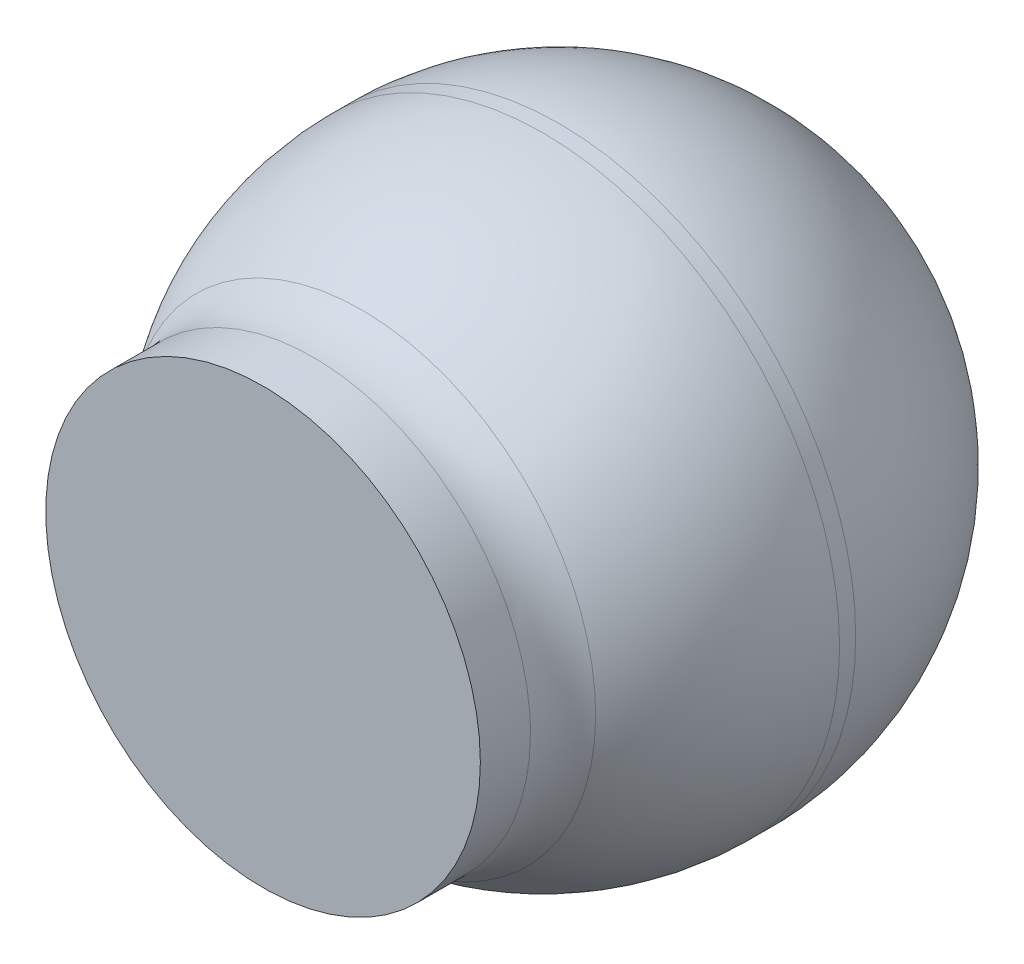
ISO-10303-21;
HEADER;
FILE_DESCRIPTION(('STEP AP214'),'2;1');
FILE_NAME('part.step','',(''),(''),'','','');
FILE_SCHEMA(('AUTOMOTIVE_DESIGN { 1 0 10303 214 1 1 1 1 }'));
ENDSEC;
DATA;
#1=APPLICATION_CONTEXT('core data for automotive mechanical design processes');
#2=APPLICATION_PROTOCOL_DEFINITION('international standard','automotive_design',2000,#1);
#3=PRODUCT_CONTEXT('',#1,'mechanical');
#4=PRODUCT('Part','Part','',(#3));
#5=PRODUCT_RELATED_PRODUCT_CATEGORY('part','',(#4));
#6=PRODUCT_DEFINITION_FORMATION('','',#4);
#7=PRODUCT_DEFINITION_CONTEXT('part definition',#1,'design');
#8=PRODUCT_DEFINITION('design','',#6,#7);
#9=PRODUCT_DEFINITION_SHAPE('','',#8);
#10=(LENGTH_UNIT() NAMED_UNIT(*) SI_UNIT(.MILLI.,.METRE.));
#11=(NAMED_UNIT(*) PLANE_ANGLE_UNIT() SI_UNIT($,.RADIAN.));
#12=(NAMED_UNIT(*) SI_UNIT($,.STERADIAN.) SOLID_ANGLE_UNIT());
#13=UNCERTAINTY_MEASURE_WITH_UNIT(LENGTH_MEASURE(1.E-05),#10,'distance_accuracy_value','');
#14=(GEOMETRIC_REPRESENTATION_CONTEXT(3) GLOBAL_UNCERTAINTY_ASSIGNED_CONTEXT((#13)) GLOBAL_UNIT_ASSIGNED_CONTEXT((#10,
#11,#12)) REPRESENTATION_CONTEXT('',''));
#15=CARTESIAN_POINT('',(0.,0.,0.));
#16=DIRECTION('',(0.,0.,1.));
#17=DIRECTION('',(1.,0.,0.));
#18=AXIS2_PLACEMENT_3D('',#15,#16,#17);
#19=CARTESIAN_POINT('',(-5.642919922269,-10.40134929145,10.006534503384));
#20=DIRECTION('',(0.,0.,-1.));
#21=DIRECTION('',(-1.,0.,0.));
#22=AXIS2_PLACEMENT_3D('',#19,#20,#21);
#23=PLANE('',#22);
#24=CARTESIAN_POINT('',(-5.642919922269,-10.40134929145,10.006534503384));
#25=DIRECTION('',(0.,0.,1.));
#26=DIRECTION('',(1.,0.,0.));
#27=AXIS2_PLACEMENT_3D('',#24,#25,#26);
#28=CIRCLE('',#27,0.275);
#29=CARTESIAN_POINT('',(-5.367919922269,-10.40134929145,10.006534503384));
#30=VERTEX_POINT('',#29);
#31=EDGE_CURVE('E20',#30,#30,#28,.F.);
#32=ORIENTED_EDGE('',*,*,#31,.F.);
#33=EDGE_LOOP('',(#32));
#34=FACE_BOUND('',#33,.T.);
#35=ADVANCED_FACE('F17',(#34),#23,.F.);
#36=CARTESIAN_POINT('',(-5.642919922269,-10.40134929145,9.906534503384));
#37=DIRECTION('',(0.,0.,1.));
#38=DIRECTION('',(1.,0.,0.));
#39=AXIS2_PLACEMENT_3D('',#36,#37,#38);
#40=CYLINDRICAL_SURFACE('',#39,0.275);
#41=CARTESIAN_POINT('',(-5.642919922269,-10.40134929145,9.943180457728));
#42=DIRECTION('',(0.,0.,-1.));
#43=DIRECTION('',(0.996700902337582,0.081162252799247,0.));
#44=AXIS2_PLACEMENT_3D('',#41,#42,#43);
#45=CIRCLE('',#44,0.275);
#46=CARTESIAN_POINT('',(-5.36882717412616,-10.3790296719302,9.943180457728));
#47=VERTEX_POINT('',#46);
#48=EDGE_CURVE('E66',#47,#47,#45,.F.);
#49=ORIENTED_EDGE('',*,*,#48,.T.);
#50=EDGE_LOOP('',(#49));
#51=FACE_BOUND('',#50,.T.);
#52=ORIENTED_EDGE('',*,*,#31,.T.);
#53=EDGE_LOOP('',(#52));
#54=FACE_BOUND('',#53,.T.);
#55=ADVANCED_FACE('F62',(#51,#54),#40,.T.);
#56=CARTESIAN_POINT('',(-5.642919922269,-10.40134929145,9.943180457728));
#57=DIRECTION('',(0.,0.,-1.));
#58=DIRECTION('',(0.996700902337583,0.0811622527992448,0.));
#59=AXIS2_PLACEMENT_3D('',#56,#57,#58);
#60=TOROIDAL_SURFACE('',#59,0.375,0.1);
#61=ORIENTED_EDGE('',*,*,#48,.F.);
#62=EDGE_LOOP('',(#61));
#63=FACE_BOUND('',#62,.T.);
#64=CARTESIAN_POINT('',(-5.642919922269,-10.40134929145,9.881744931236));
#65=DIRECTION('',(0.,0.,-1.));
#66=DIRECTION('',(-0.99670090233869,-0.081162252785641,0.));
#67=AXIS2_PLACEMENT_3D('',#64,#65,#66);
#68=CIRCLE('',#67,0.296097046412341);
#69=CARTESIAN_POINT('',(-5.938040115608,-10.42538119478,9.881744931236));
#70=VERTEX_POINT('',#69);
#71=EDGE_CURVE('E39',#70,#70,#68,.T.);
#72=ORIENTED_EDGE('',*,*,#71,.F.);
#73=EDGE_LOOP('',(#72));
#74=FACE_BOUND('',#73,.T.);
#75=ADVANCED_FACE('F57',(#63,#74),#60,.F.);
#76=CARTESIAN_POINT('',(-6.016682760645,-10.43178513625,9.651976062157));
#77=CARTESIAN_POINT('',(-6.016682760645,-10.43178513625,9.701461392103));
#78=CARTESIAN_POINT('',(-6.008526217348,-10.43112094157,9.750947004335));
#79=CARTESIAN_POINT('',(-5.992207085349,-10.42979205995,9.798626332798));
#80=CARTESIAN_POINT('',(-5.968341390838,-10.42784865493,9.842699544317));
#81=CARTESIAN_POINT('',(-5.938040115608,-10.42538119478,9.881744931236));
#82=(BOUNDED_CURVE() B_SPLINE_CURVE(5,(#76,#77,#78,#79,#80,#81),.UNSPECIFIED.,.F.,
.F.) B_SPLINE_CURVE_WITH_KNOTS((6,6),(0.,0.661568582165),
.UNSPECIFIED.) CURVE() GEOMETRIC_REPRESENTATION_ITEM() RATIONAL_B_SPLINE_CURVE((1.,1.,1.,1.,1.,1.)) REPRESENTATION_ITEM(''));
#83=CARTESIAN_POINT('',(-5.642919922269,-10.40134929145,9.651976062157));
#84=DIRECTION('',(0.,0.,-1.));
#85=AXIS1_PLACEMENT('',#83,#84);
#86=SURFACE_OF_REVOLUTION('',#82,#85);
#87=CARTESIAN_POINT('',(-5.642919922269,-10.40134929145,9.651976062157));
#88=DIRECTION('',(0.,0.,1.));
#89=DIRECTION('',(1.,0.,0.));
#90=AXIS2_PLACEMENT_3D('',#87,#88,#89);
#91=CIRCLE('',#90,0.375);
#92=CARTESIAN_POINT('',(-5.267919922269,-10.40134929145,9.651976062157));
#93=VERTEX_POINT('',#92);
#94=EDGE_CURVE('E36',#93,#93,#91,.F.);
#95=ORIENTED_EDGE('',*,*,#94,.F.);
#96=EDGE_LOOP('',(#95));
#97=FACE_BOUND('',#96,.T.);
#98=ORIENTED_EDGE('',*,*,#71,.T.);
#99=EDGE_LOOP('',(#98));
#100=FACE_BOUND('',#99,.T.);
#101=ADVANCED_FACE('F53',(#97,#100),#86,.F.);
#102=CARTESIAN_POINT('',(-5.642919922269,-10.40134929145,9.256534503384));
#103=DIRECTION('',(0.,0.,1.));
#104=DIRECTION('',(1.,0.,0.));
#105=AXIS2_PLACEMENT_3D('',#102,#103,#104);
#106=CYLINDRICAL_SURFACE('',#105,0.375);
#107=CARTESIAN_POINT('',(-5.642919922269,-10.40134929145,9.631534503384));
#108=DIRECTION('',(0.,0.,-1.));
#109=DIRECTION('',(0.0811622527992357,-0.996700902337583,0.));
#110=AXIS2_PLACEMENT_3D('',#107,#108,#109);
#111=CIRCLE('',#110,0.375);
#112=CARTESIAN_POINT('',(-5.61248407746929,-10.7751121298266,9.631534503384));
#113=VERTEX_POINT('',#112);
#114=CARTESIAN_POINT('',(-5.67335576706871,-10.0275864530734,9.631534503384));
#115=VERTEX_POINT('',#114);
#116=EDGE_CURVE('E11',#113,#115,#111,.T.);
#117=ORIENTED_EDGE('',*,*,#116,.F.);
#118=CARTESIAN_POINT('',(-5.642919922269,-10.40134929145,9.631534503384));
#119=DIRECTION('',(3.33436315446763E-12,2.72100352061447E-13,1.));
#120=DIRECTION('',(0.0811622527992365,-0.996700902337583,0.));
#121=AXIS2_PLACEMENT_3D('',#118,#119,#120);
#122=CIRCLE('',#121,0.375);
#123=EDGE_CURVE('E25',#115,#113,#122,.F.);
#124=ORIENTED_EDGE('',*,*,#123,.F.);
#125=EDGE_LOOP('',(#117,#124));
#126=FACE_BOUND('',#125,.T.);
#127=ORIENTED_EDGE('',*,*,#94,.T.);
#128=EDGE_LOOP('',(#127));
#129=FACE_BOUND('',#128,.T.);
#130=ADVANCED_FACE('F34',(#126,#129),#106,.T.);
#131=CARTESIAN_POINT('',(-5.642919922269,-10.40134929145,9.631534503384));
#132=DIRECTION('',(0.0811622527992361,-0.996700902337583,0.));
#133=DIRECTION('',(-0.996700902337583,-0.0811622527992361,0.));
#134=AXIS2_PLACEMENT_3D('',#131,#132,#133);
#135=SPHERICAL_SURFACE('',#134,0.375);
#136=ORIENTED_EDGE('',*,*,#123,.T.);
#137=ORIENTED_EDGE('',*,*,#116,.T.);
#138=EDGE_LOOP('',(#136,#137));
#139=FACE_BOUND('',#138,.T.);
#140=ADVANCED_FACE('F32',(#139),#135,.T.);
#141=CLOSED_SHELL('',(#35,#55,#75,#101,#130,#140));
#142=MANIFOLD_SOLID_BREP('B1',#141);
#143=ADVANCED_BREP_SHAPE_REPRESENTATION('',(#18,#142),#14);
#144=SHAPE_DEFINITION_REPRESENTATION(#9,#143);
ENDSEC;
END-ISO-10303-21;
